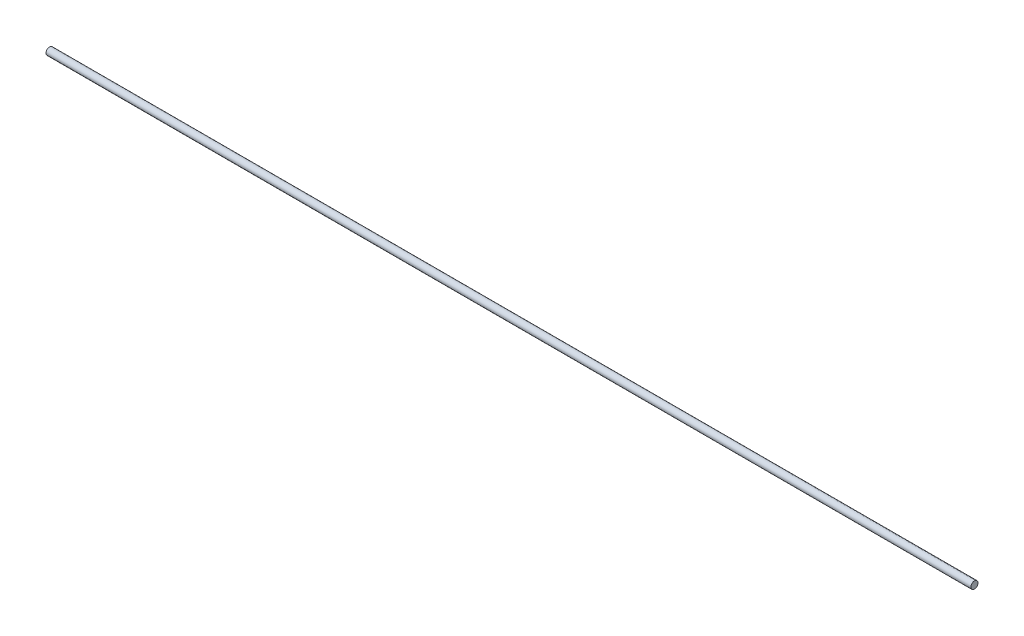
ISO-10303-21;
HEADER;
FILE_DESCRIPTION(('STEP AP214'),'2;1');
FILE_NAME('part.step','',(''),(''),'','','');
FILE_SCHEMA(('AUTOMOTIVE_DESIGN { 1 0 10303 214 1 1 1 1 }'));
ENDSEC;
DATA;
#1=APPLICATION_CONTEXT('core data for automotive mechanical design processes');
#2=APPLICATION_PROTOCOL_DEFINITION('international standard','automotive_design',2000,#1);
#3=PRODUCT_CONTEXT('',#1,'mechanical');
#4=PRODUCT('Part','Part','',(#3));
#5=PRODUCT_RELATED_PRODUCT_CATEGORY('part','',(#4));
#6=PRODUCT_DEFINITION_FORMATION('','',#4);
#7=PRODUCT_DEFINITION_CONTEXT('part definition',#1,'design');
#8=PRODUCT_DEFINITION('design','',#6,#7);
#9=PRODUCT_DEFINITION_SHAPE('','',#8);
#10=(LENGTH_UNIT() NAMED_UNIT(*) SI_UNIT(.MILLI.,.METRE.));
#11=(NAMED_UNIT(*) PLANE_ANGLE_UNIT() SI_UNIT($,.RADIAN.));
#12=(NAMED_UNIT(*) SI_UNIT($,.STERADIAN.) SOLID_ANGLE_UNIT());
#13=UNCERTAINTY_MEASURE_WITH_UNIT(LENGTH_MEASURE(1.E-05),#10,'distance_accuracy_value','');
#14=(GEOMETRIC_REPRESENTATION_CONTEXT(3) GLOBAL_UNCERTAINTY_ASSIGNED_CONTEXT((#13)) GLOBAL_UNIT_ASSIGNED_CONTEXT((#10,
#11,#12)) REPRESENTATION_CONTEXT('',''));
#15=CARTESIAN_POINT('',(0.,0.,0.));
#16=DIRECTION('',(0.,0.,1.));
#17=DIRECTION('',(1.,0.,0.));
#18=AXIS2_PLACEMENT_3D('',#15,#16,#17);
#19=CARTESIAN_POINT('',(514.018369381486,2.72965119199853,-1.24757696488587));
#20=DIRECTION('',(-1.,0.,0.));
#21=DIRECTION('',(0.,0.,1.));
#22=AXIS2_PLACEMENT_3D('',#19,#20,#21);
#23=CYLINDRICAL_SURFACE('',#22,4.);
#24=CARTESIAN_POINT('',(514.018369381486,2.72965119199853,-1.24757696488587));
#25=DIRECTION('',(1.,0.,0.));
#26=DIRECTION('',(0.,0.,-1.));
#27=AXIS2_PLACEMENT_3D('',#24,#25,#26);
#28=CIRCLE('',#27,4.);
#29=CARTESIAN_POINT('',(514.018369381486,2.72965119199853,-5.24757696488587));
#30=VERTEX_POINT('',#29);
#31=EDGE_CURVE('E9',#30,#30,#28,.T.);
#32=ORIENTED_EDGE('',*,*,#31,.F.);
#33=EDGE_LOOP('',(#32));
#34=FACE_BOUND('',#33,.T.);
#35=CARTESIAN_POINT('',(-516.981630618514,2.72965119199853,-1.24757696488587));
#36=DIRECTION('',(1.,0.,0.));
#37=DIRECTION('',(0.,0.,-1.));
#38=AXIS2_PLACEMENT_3D('',#35,#36,#37);
#39=CIRCLE('',#38,4.);
#40=CARTESIAN_POINT('',(-516.981630618514,2.72965119199853,-5.24757696488587));
#41=VERTEX_POINT('',#40);
#42=EDGE_CURVE('E17',#41,#41,#39,.T.);
#43=ORIENTED_EDGE('',*,*,#42,.T.);
#44=EDGE_LOOP('',(#43));
#45=FACE_BOUND('',#44,.T.);
#46=ADVANCED_FACE('F14',(#34,#45),#23,.T.);
#47=CARTESIAN_POINT('',(514.018369381486,2.72965119199853,-1.24757696488587));
#48=DIRECTION('',(1.,0.,0.));
#49=DIRECTION('',(0.,0.,-1.));
#50=AXIS2_PLACEMENT_3D('',#47,#48,#49);
#51=PLANE('',#50);
#52=ORIENTED_EDGE('',*,*,#31,.T.);
#53=EDGE_LOOP('',(#52));
#54=FACE_BOUND('',#53,.T.);
#55=ADVANCED_FACE('F29',(#54),#51,.T.);
#56=CARTESIAN_POINT('',(-516.981630618514,2.72965119199853,-1.24757696488587));
#57=DIRECTION('',(1.,0.,0.));
#58=DIRECTION('',(0.,0.,-1.));
#59=AXIS2_PLACEMENT_3D('',#56,#57,#58);
#60=PLANE('',#59);
#61=ORIENTED_EDGE('',*,*,#42,.F.);
#62=EDGE_LOOP('',(#61));
#63=FACE_BOUND('',#62,.T.);
#64=ADVANCED_FACE('F27',(#63),#60,.F.);
#65=CLOSED_SHELL('',(#46,#55,#64));
#66=MANIFOLD_SOLID_BREP('B1',#65);
#67=ADVANCED_BREP_SHAPE_REPRESENTATION('',(#18,#66),#14);
#68=SHAPE_DEFINITION_REPRESENTATION(#9,#67);
ENDSEC;
END-ISO-10303-21;
